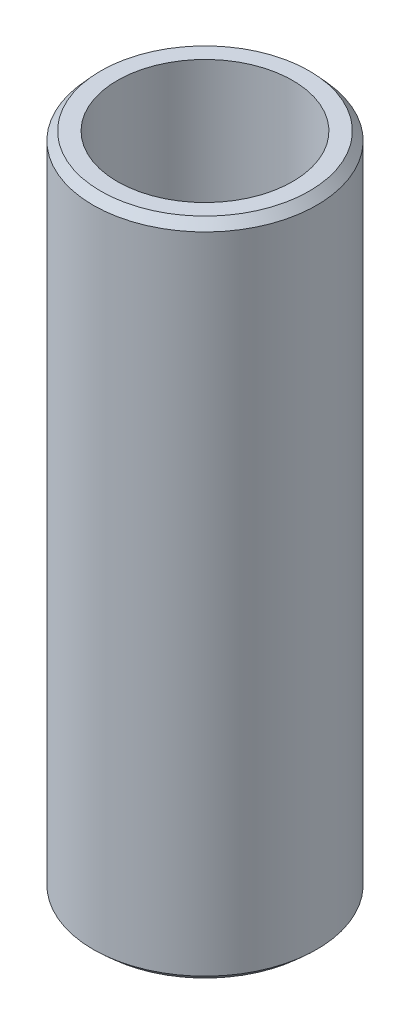
ISO-10303-21;
HEADER;
FILE_DESCRIPTION(('STEP AP214'),'2;1');
FILE_NAME('part.step','',(''),(''),'','','');
FILE_SCHEMA(('AUTOMOTIVE_DESIGN { 1 0 10303 214 1 1 1 1 }'));
ENDSEC;
DATA;
#1=APPLICATION_CONTEXT('core data for automotive mechanical design processes');
#2=APPLICATION_PROTOCOL_DEFINITION('international standard','automotive_design',2000,#1);
#3=PRODUCT_CONTEXT('',#1,'mechanical');
#4=PRODUCT('Part','Part','',(#3));
#5=PRODUCT_RELATED_PRODUCT_CATEGORY('part','',(#4));
#6=PRODUCT_DEFINITION_FORMATION('','',#4);
#7=PRODUCT_DEFINITION_CONTEXT('part definition',#1,'design');
#8=PRODUCT_DEFINITION('design','',#6,#7);
#9=PRODUCT_DEFINITION_SHAPE('','',#8);
#10=(LENGTH_UNIT() NAMED_UNIT(*) SI_UNIT(.MILLI.,.METRE.));
#11=(NAMED_UNIT(*) PLANE_ANGLE_UNIT() SI_UNIT($,.RADIAN.));
#12=(NAMED_UNIT(*) SI_UNIT($,.STERADIAN.) SOLID_ANGLE_UNIT());
#13=UNCERTAINTY_MEASURE_WITH_UNIT(LENGTH_MEASURE(1.E-05),#10,'distance_accuracy_value','');
#14=(GEOMETRIC_REPRESENTATION_CONTEXT(3) GLOBAL_UNCERTAINTY_ASSIGNED_CONTEXT((#13)) GLOBAL_UNIT_ASSIGNED_CONTEXT((#10,
#11,#12)) REPRESENTATION_CONTEXT('',''));
#15=CARTESIAN_POINT('',(0.,0.,0.));
#16=DIRECTION('',(0.,0.,1.));
#17=DIRECTION('',(1.,0.,0.));
#18=AXIS2_PLACEMENT_3D('',#15,#16,#17);
#19=CARTESIAN_POINT('',(0.,221.480465160146,0.));
#20=DIRECTION('',(0.,-1.,0.));
#21=DIRECTION('',(0.,0.,-1.));
#22=AXIS2_PLACEMENT_3D('',#19,#20,#21);
#23=CYLINDRICAL_SURFACE('',#22,37.5);
#24=CARTESIAN_POINT('',(0.,218.669795149218,0.));
#25=DIRECTION('',(0.,1.,0.));
#26=DIRECTION('',(0.,0.,1.));
#27=AXIS2_PLACEMENT_3D('',#24,#25,#26);
#28=CIRCLE('',#27,37.5);
#29=CARTESIAN_POINT('',(0.,218.669795149218,37.5));
#30=VERTEX_POINT('',#29);
#31=EDGE_CURVE('E50',#30,#30,#28,.F.);
#32=ORIENTED_EDGE('',*,*,#31,.T.);
#33=EDGE_LOOP('',(#32));
#34=FACE_BOUND('',#33,.T.);
#35=CARTESIAN_POINT('',(0.,2.54211412912,0.));
#36=DIRECTION('',(0.,1.,0.));
#37=DIRECTION('',(0.,0.,1.));
#38=AXIS2_PLACEMENT_3D('',#35,#36,#37);
#39=CIRCLE('',#38,37.5);
#40=CARTESIAN_POINT('',(0.,2.54211412912,37.5));
#41=VERTEX_POINT('',#40);
#42=EDGE_CURVE('E51',#41,#41,#39,.T.);
#43=ORIENTED_EDGE('',*,*,#42,.T.);
#44=EDGE_LOOP('',(#43));
#45=FACE_BOUND('',#44,.T.);
#46=ADVANCED_FACE('F39',(#34,#45),#23,.T.);
#47=CARTESIAN_POINT('',(0.,221.480465160146,0.));
#48=DIRECTION('',(0.,1.,0.));
#49=DIRECTION('',(0.,0.,1.));
#50=AXIS2_PLACEMENT_3D('',#47,#48,#49);
#51=PLANE('',#50);
#52=CARTESIAN_POINT('',(0.,221.480465160146,0.));
#53=DIRECTION('',(0.,1.,0.));
#54=DIRECTION('',(0.,0.,1.));
#55=AXIS2_PLACEMENT_3D('',#52,#53,#54);
#56=CIRCLE('',#55,34.9578858708799);
#57=CARTESIAN_POINT('',(0.,221.480465160146,34.9578858708799));
#58=VERTEX_POINT('',#57);
#59=EDGE_CURVE('E54',#58,#58,#56,.T.);
#60=ORIENTED_EDGE('',*,*,#59,.T.);
#61=EDGE_LOOP('',(#60));
#62=FACE_BOUND('',#61,.T.);
#63=CARTESIAN_POINT('',(0.,221.480465160146,0.));
#64=DIRECTION('',(0.,1.,0.));
#65=DIRECTION('',(0.,0.,1.));
#66=AXIS2_PLACEMENT_3D('',#63,#64,#65);
#67=CIRCLE('',#66,29.3966767921165);
#68=CARTESIAN_POINT('',(0.,221.480465160146,29.3966767921165));
#69=VERTEX_POINT('',#68);
#70=EDGE_CURVE('E58',#69,#69,#67,.T.);
#71=ORIENTED_EDGE('',*,*,#70,.F.);
#72=EDGE_LOOP('',(#71));
#73=FACE_BOUND('',#72,.T.);
#74=ADVANCED_FACE('F69',(#62,#73),#51,.T.);
#75=CARTESIAN_POINT('',(0.,0.,0.));
#76=DIRECTION('',(0.,1.,0.));
#77=DIRECTION('',(0.,0.,1.));
#78=AXIS2_PLACEMENT_3D('',#75,#76,#77);
#79=PLANE('',#78);
#80=CARTESIAN_POINT('',(0.,0.,0.));
#81=DIRECTION('',(0.,1.,0.));
#82=DIRECTION('',(0.,0.,1.));
#83=AXIS2_PLACEMENT_3D('',#80,#81,#82);
#84=CIRCLE('',#83,34.6893299890724);
#85=CARTESIAN_POINT('',(0.,0.,34.6893299890724));
#86=VERTEX_POINT('',#85);
#87=EDGE_CURVE('E10',#86,#86,#84,.F.);
#88=ORIENTED_EDGE('',*,*,#87,.T.);
#89=EDGE_LOOP('',(#88));
#90=FACE_BOUND('',#89,.T.);
#91=CARTESIAN_POINT('',(0.,0.,0.));
#92=DIRECTION('',(0.,1.,0.));
#93=DIRECTION('',(0.,0.,1.));
#94=AXIS2_PLACEMENT_3D('',#91,#92,#93);
#95=CIRCLE('',#94,29.3966767921165);
#96=CARTESIAN_POINT('',(0.,0.,29.3966767921165));
#97=VERTEX_POINT('',#96);
#98=EDGE_CURVE('E63',#97,#97,#95,.T.);
#99=ORIENTED_EDGE('',*,*,#98,.T.);
#100=EDGE_LOOP('',(#99));
#101=FACE_BOUND('',#100,.T.);
#102=ADVANCED_FACE('F75',(#90,#101),#79,.F.);
#103=CARTESIAN_POINT('',(0.,221.480465160146,0.));
#104=DIRECTION('',(0.,-1.,0.));
#105=DIRECTION('',(0.,0.,-1.));
#106=AXIS2_PLACEMENT_3D('',#103,#104,#105);
#107=CYLINDRICAL_SURFACE('',#106,29.3966767921165);
#108=ORIENTED_EDGE('',*,*,#70,.T.);
#109=EDGE_LOOP('',(#108));
#110=FACE_BOUND('',#109,.T.);
#111=ORIENTED_EDGE('',*,*,#98,.F.);
#112=EDGE_LOOP('',(#111));
#113=FACE_BOUND('',#112,.T.);
#114=ADVANCED_FACE('F70',(#110,#113),#107,.F.);
#115=CARTESIAN_POINT('',(0.,221.480465160146,0.));
#116=DIRECTION('',(0.,-1.,0.));
#117=DIRECTION('',(0.,0.,-1.));
#118=AXIS2_PLACEMENT_3D('',#115,#116,#117);
#119=CONICAL_SURFACE('',#118,34.9578858708799,0.735268944232907);
#120=ORIENTED_EDGE('',*,*,#31,.F.);
#121=EDGE_LOOP('',(#120));
#122=FACE_BOUND('',#121,.T.);
#123=ORIENTED_EDGE('',*,*,#59,.F.);
#124=EDGE_LOOP('',(#123));
#125=FACE_BOUND('',#124,.T.);
#126=ADVANCED_FACE('F81',(#122,#125),#119,.T.);
#127=CARTESIAN_POINT('',(0.,2.54211412912,0.));
#128=DIRECTION('',(0.,1.,0.));
#129=DIRECTION('',(0.,0.,1.));
#130=AXIS2_PLACEMENT_3D('',#127,#128,#129);
#131=CONICAL_SURFACE('',#130,37.5,0.83552738256199);
#132=CARTESIAN_POINT('',(0.,0.,34.6893299890724));
#133=CARTESIAN_POINT('',(0.,0.0264803555116663,34.7186078016862));
#134=CARTESIAN_POINT('',(0.,0.052960711023333,34.7478856143001));
#135=CARTESIAN_POINT('',(0.,0.105921422046666,34.8064412395277));
#136=CARTESIAN_POINT('',(0.,0.132401777558333,34.8357190521415));
#137=CARTESIAN_POINT('',(0.,0.185362488581667,34.8942746773692));
#138=CARTESIAN_POINT('',(0.,0.211842844093333,34.923552489983));
#139=CARTESIAN_POINT('',(0.,0.264803555116667,34.9821081152107));
#140=CARTESIAN_POINT('',(0.,0.291283910628333,35.0113859278245));
#141=CARTESIAN_POINT('',(0.,0.344244621651667,35.0699415530522));
#142=CARTESIAN_POINT('',(0.,0.370724977163334,35.099219365666));
#143=CARTESIAN_POINT('',(0.,0.423685688186667,35.1577749908937));
#144=CARTESIAN_POINT('',(0.,0.450166043698334,35.1870528035075));
#145=CARTESIAN_POINT('',(0.,0.503126754721667,35.2456084287352));
#146=CARTESIAN_POINT('',(0.,0.529607110233334,35.274886241349));
#147=CARTESIAN_POINT('',(0.,0.582567821256667,35.3334418665766));
#148=CARTESIAN_POINT('',(0.,0.609048176768334,35.3627196791905));
#149=CARTESIAN_POINT('',(0.,0.662008887791667,35.4212753044181));
#150=CARTESIAN_POINT('',(0.,0.688489243303334,35.450553117032));
#151=CARTESIAN_POINT('',(0.,0.741449954326667,35.5091087422596));
#152=CARTESIAN_POINT('',(0.,0.767930309838334,35.5383865548734));
#153=CARTESIAN_POINT('',(0.,0.820891020861668,35.5969421801011));
#154=CARTESIAN_POINT('',(0.,0.847371376373334,35.6262199927149));
#155=CARTESIAN_POINT('',(0.,0.900332087396668,35.6847756179426));
#156=CARTESIAN_POINT('',(0.,0.926812442908335,35.7140534305564));
#157=CARTESIAN_POINT('',(0.,0.979773153931668,35.7726090557841));
#158=CARTESIAN_POINT('',(0.,1.00625350944333,35.8018868683979));
#159=CARTESIAN_POINT('',(0.,1.05921422046667,35.8604424936256));
#160=CARTESIAN_POINT('',(0.,1.08569457597833,35.8897203062394));
#161=CARTESIAN_POINT('',(0.,1.13865528700167,35.9482759314671));
#162=CARTESIAN_POINT('',(0.,1.16513564251334,35.9775537440809));
#163=CARTESIAN_POINT('',(0.,1.21809635353667,36.0361093693085));
#164=CARTESIAN_POINT('',(0.,1.24457670904834,36.0653871819224));
#165=CARTESIAN_POINT('',(0.,1.29753742007167,36.12394280715));
#166=CARTESIAN_POINT('',(0.,1.32401777558334,36.1532206197639));
#167=CARTESIAN_POINT('',(0.,1.37697848660667,36.2117762449915));
#168=CARTESIAN_POINT('',(0.,1.40345884211834,36.2410540576053));
#169=CARTESIAN_POINT('',(0.,1.45641955314167,36.299609682833));
#170=CARTESIAN_POINT('',(0.,1.48289990865334,36.3288874954468));
#171=CARTESIAN_POINT('',(0.,1.53586061967667,36.3874431206745));
#172=CARTESIAN_POINT('',(0.,1.56234097518834,36.4167209332883));
#173=CARTESIAN_POINT('',(0.,1.61530168621167,36.475276558516));
#174=CARTESIAN_POINT('',(0.,1.64178204172334,36.5045543711298));
#175=CARTESIAN_POINT('',(0.,1.69474275274667,36.5631099963575));
#176=CARTESIAN_POINT('',(0.,1.72122310825834,36.5923878089713));
#177=CARTESIAN_POINT('',(0.,1.77418381928167,36.650943434199));
#178=CARTESIAN_POINT('',(0.,1.80066417479334,36.6802212468128));
#179=CARTESIAN_POINT('',(0.,1.85362488581667,36.7387768720404));
#180=CARTESIAN_POINT('',(0.,1.88010524132834,36.7680546846543));
#181=CARTESIAN_POINT('',(0.,1.93306595235167,36.8266103098819));
#182=CARTESIAN_POINT('',(0.,1.95954630786334,36.8558881224958));
#183=CARTESIAN_POINT('',(0.,2.01250701888667,36.9144437477234));
#184=CARTESIAN_POINT('',(0.,2.03898737439834,36.9437215603372));
#185=CARTESIAN_POINT('',(0.,2.09194808542167,37.0022771855649));
#186=CARTESIAN_POINT('',(0.,2.11842844093334,37.0315549981787));
#187=CARTESIAN_POINT('',(0.,2.17138915195667,37.0901106234064));
#188=CARTESIAN_POINT('',(0.,2.19786950746834,37.1193884360202));
#189=CARTESIAN_POINT('',(0.,2.25083021849167,37.1779440612479));
#190=CARTESIAN_POINT('',(0.,2.27731057400334,37.2072218738617));
#191=CARTESIAN_POINT('',(0.,2.33027128502667,37.2657774990894));
#192=CARTESIAN_POINT('',(0.,2.35675164053834,37.2950553117032));
#193=CARTESIAN_POINT('',(0.,2.40971235156167,37.3536109369309));
#194=CARTESIAN_POINT('',(0.,2.43619270707334,37.3828887495447));
#195=CARTESIAN_POINT('',(0.,2.48915341809667,37.4414443747724));
#196=CARTESIAN_POINT('',(0.,2.51563377360834,37.4707221873862));
#197=CARTESIAN_POINT('',(0.,2.54211412912,37.5));
#198=B_SPLINE_CURVE_WITH_KNOTS('',3,(#132,#133,#134,#135,#136,#137,#138,#139,#140,#141,#142,
#143,#144,#145,#146,#147,#148,#149,#150,#151,#152,#153,#154,#155,#156,#157,#158,#159,#160,#161,
#162,#163,#164,#165,#166,#167,#168,#169,#170,#171,#172,#173,#174,#175,#176,#177,#178,#179,#180,
#181,#182,#183,#184,#185,#186,#187,#188,#189,#190,#191,#192,#193,#194,#195,#196,#197),
.UNSPECIFIED.,.F.,.F.,(4,2,2,2,2,2,2,2,2,2,2,2,2,2,2,2,2,2,2,2,2,2,2,2,2,2,2,2,2,2,2,2,4),(0.,
0.118429708499484,0.236859416998968,0.355289125498453,0.473718833997937,0.592148542497421,
0.710578250996905,0.82900795949639,0.947437667995874,1.06586737649536,1.18429708499484,
1.30272679349433,1.42115650199381,1.5395862104933,1.65801591899278,1.77644562749226,
1.89487533599175,2.01330504449123,2.13173475299072,2.2501644614902,2.36859416998968,
2.48702387848917,2.60545358698865,2.72388329548814,2.84231300398762,2.96074271248711,
3.07917242098659,3.19760212948607,3.31603183798556,3.43446154648504,3.55289125498453,
3.67132096348401,3.78975067198349),.UNSPECIFIED.);
#199=EDGE_CURVE('BSEAM45',#86,#41,#198,.T.);
#200=ORIENTED_EDGE('',*,*,#87,.F.);
#201=ORIENTED_EDGE('',*,*,#42,.F.);
#202=ORIENTED_EDGE('',*,*,#199,.T.);
#203=ORIENTED_EDGE('',*,*,#199,.F.);
#204=EDGE_LOOP('',(#200,#202,#201,#203));
#205=FACE_BOUND('',#204,.T.);
#206=ADVANCED_FACE('F45',(#205),#131,.T.);
#207=CLOSED_SHELL('',(#46,#74,#102,#114,#126,#206));
#208=MANIFOLD_SOLID_BREP('B2',#207);
#209=ADVANCED_BREP_SHAPE_REPRESENTATION('',(#18,#208),#14);
#210=SHAPE_DEFINITION_REPRESENTATION(#9,#209);
ENDSEC;
END-ISO-10303-21;
